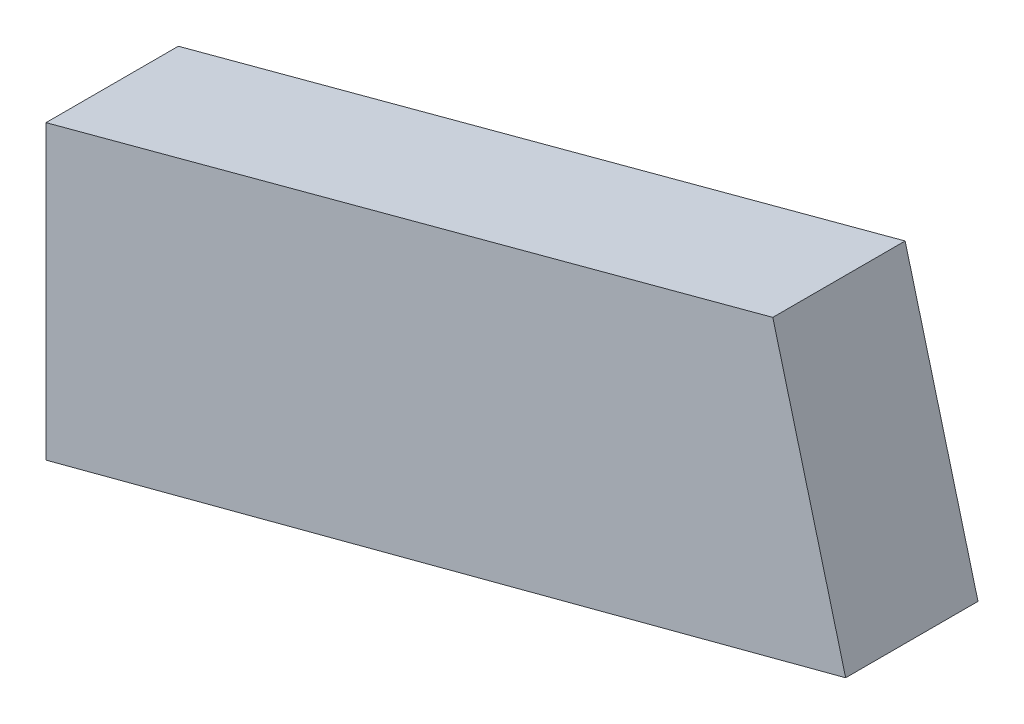
ISO-10303-21;
HEADER;
FILE_DESCRIPTION(('STEP AP214'),'2;1');
FILE_NAME('part.step','',(''),(''),'','','');
FILE_SCHEMA(('AUTOMOTIVE_DESIGN { 1 0 10303 214 1 1 1 1 }'));
ENDSEC;
DATA;
#1=APPLICATION_CONTEXT('core data for automotive mechanical design processes');
#2=APPLICATION_PROTOCOL_DEFINITION('international standard','automotive_design',2000,#1);
#3=PRODUCT_CONTEXT('',#1,'mechanical');
#4=PRODUCT('Part','Part','',(#3));
#5=PRODUCT_RELATED_PRODUCT_CATEGORY('part','',(#4));
#6=PRODUCT_DEFINITION_FORMATION('','',#4);
#7=PRODUCT_DEFINITION_CONTEXT('part definition',#1,'design');
#8=PRODUCT_DEFINITION('design','',#6,#7);
#9=PRODUCT_DEFINITION_SHAPE('','',#8);
#10=(LENGTH_UNIT() NAMED_UNIT(*) SI_UNIT(.MILLI.,.METRE.));
#11=(NAMED_UNIT(*) PLANE_ANGLE_UNIT() SI_UNIT($,.RADIAN.));
#12=(NAMED_UNIT(*) SI_UNIT($,.STERADIAN.) SOLID_ANGLE_UNIT());
#13=UNCERTAINTY_MEASURE_WITH_UNIT(LENGTH_MEASURE(1.E-05),#10,'distance_accuracy_value','');
#14=(GEOMETRIC_REPRESENTATION_CONTEXT(3) GLOBAL_UNCERTAINTY_ASSIGNED_CONTEXT((#13)) GLOBAL_UNIT_ASSIGNED_CONTEXT((#10,
#11,#12)) REPRESENTATION_CONTEXT('',''));
#15=CARTESIAN_POINT('',(0.,0.,0.));
#16=DIRECTION('',(0.,0.,1.));
#17=DIRECTION('',(1.,0.,0.));
#18=AXIS2_PLACEMENT_3D('',#15,#16,#17);
#19=CARTESIAN_POINT('',(0.,26.5033331540804,12.));
#20=DIRECTION('',(1.,0.,0.));
#21=DIRECTION('',(0.,1.,0.));
#22=AXIS2_PLACEMENT_3D('',#19,#20,#21);
#23=PLANE('',#22);
#24=DIRECTION('',(0.,-1.,0.));
#25=VECTOR('',#24,1.);
#26=CARTESIAN_POINT('',(0.,26.5033331540804,0.));
#27=LINE('',#26,#25);
#28=CARTESIAN_POINT('',(0.,26.5033331540804,0.));
#29=VERTEX_POINT('',#28);
#30=CARTESIAN_POINT('',(0.,0.,0.));
#31=VERTEX_POINT('',#30);
#32=EDGE_CURVE('E96',#29,#31,#27,.T.);
#33=ORIENTED_EDGE('',*,*,#32,.T.);
#34=DIRECTION('',(0.,0.,-1.));
#35=VECTOR('',#34,1.);
#36=CARTESIAN_POINT('',(0.,0.,12.));
#37=LINE('',#36,#35);
#38=CARTESIAN_POINT('',(0.,0.,12.));
#39=VERTEX_POINT('',#38);
#40=EDGE_CURVE('E11',#39,#31,#37,.T.);
#41=ORIENTED_EDGE('',*,*,#40,.F.);
#42=DIRECTION('',(0.,-1.,0.));
#43=VECTOR('',#42,1.);
#44=CARTESIAN_POINT('',(0.,26.5033331540804,12.));
#45=LINE('',#44,#43);
#46=CARTESIAN_POINT('',(0.,26.5033331540804,12.));
#47=VERTEX_POINT('',#46);
#48=EDGE_CURVE('E84',#47,#39,#45,.T.);
#49=ORIENTED_EDGE('',*,*,#48,.F.);
#50=DIRECTION('',(0.,0.,-1.));
#51=VECTOR('',#50,1.);
#52=CARTESIAN_POINT('',(0.,26.5033331540804,12.));
#53=LINE('',#52,#51);
#54=EDGE_CURVE('E92',#47,#29,#53,.T.);
#55=ORIENTED_EDGE('',*,*,#54,.T.);
#56=EDGE_LOOP('',(#33,#41,#49,#55));
#57=FACE_BOUND('',#56,.T.);
#58=ADVANCED_FACE('F33',(#57),#23,.F.);
#59=CARTESIAN_POINT('',(0.,0.,12.));
#60=DIRECTION('',(-0.25549690225118,0.966809874246251,0.));
#61=DIRECTION('',(-0.966809874246251,-0.25549690225118,0.));
#62=AXIS2_PLACEMENT_3D('',#59,#60,#61);
#63=PLANE('',#62);
#64=DIRECTION('',(0.966809874246251,0.25549690225118,0.));
#65=VECTOR('',#64,1.);
#66=CARTESIAN_POINT('',(0.,0.,0.));
#67=LINE('',#66,#65);
#68=CARTESIAN_POINT('',(72.5107405684688,19.1622676688385,0.));
#69=VERTEX_POINT('',#68);
#70=EDGE_CURVE('E88',#31,#69,#67,.T.);
#71=ORIENTED_EDGE('',*,*,#70,.T.);
#72=DIRECTION('',(0.,0.,-1.));
#73=VECTOR('',#72,1.);
#74=CARTESIAN_POINT('',(72.5107405684688,19.1622676688385,12.));
#75=LINE('',#74,#73);
#76=CARTESIAN_POINT('',(72.5107405684688,19.1622676688385,12.));
#77=VERTEX_POINT('',#76);
#78=EDGE_CURVE('E41',#77,#69,#75,.T.);
#79=ORIENTED_EDGE('',*,*,#78,.F.);
#80=DIRECTION('',(0.966809874246251,0.25549690225118,0.));
#81=VECTOR('',#80,1.);
#82=CARTESIAN_POINT('',(0.,0.,12.));
#83=LINE('',#82,#81);
#84=EDGE_CURVE('E79',#39,#77,#83,.T.);
#85=ORIENTED_EDGE('',*,*,#84,.F.);
#86=ORIENTED_EDGE('',*,*,#40,.T.);
#87=EDGE_LOOP('',(#71,#79,#85,#86));
#88=FACE_BOUND('',#87,.T.);
#89=ADVANCED_FACE('F87',(#88),#63,.F.);
#90=CARTESIAN_POINT('',(72.5107405684688,19.1622676688385,12.));
#91=DIRECTION('',(-0.966809874246251,-0.255496902251181,0.));
#92=DIRECTION('',(0.255496902251181,-0.966809874246251,0.));
#93=AXIS2_PLACEMENT_3D('',#90,#91,#92);
#94=PLANE('',#93);
#95=DIRECTION('',(-0.255496902251181,0.96680987424625,0.));
#96=VECTOR('',#95,1.);
#97=CARTESIAN_POINT('',(72.5107405684688,19.1622676688385,0.));
#98=LINE('',#97,#96);
#99=CARTESIAN_POINT('',(65.9040408166077,44.1622676688385,0.));
#100=VERTEX_POINT('',#99);
#101=EDGE_CURVE('E66',#69,#100,#98,.T.);
#102=ORIENTED_EDGE('',*,*,#101,.T.);
#103=DIRECTION('',(0.,0.,-1.));
#104=VECTOR('',#103,1.);
#105=CARTESIAN_POINT('',(65.9040408166077,44.1622676688385,12.));
#106=LINE('',#105,#104);
#107=CARTESIAN_POINT('',(65.9040408166077,44.1622676688385,12.));
#108=VERTEX_POINT('',#107);
#109=EDGE_CURVE('E89',#108,#100,#106,.T.);
#110=ORIENTED_EDGE('',*,*,#109,.F.);
#111=DIRECTION('',(-0.255496902251181,0.96680987424625,0.));
#112=VECTOR('',#111,1.);
#113=CARTESIAN_POINT('',(72.5107405684688,19.1622676688385,12.));
#114=LINE('',#113,#112);
#115=EDGE_CURVE('E82',#77,#108,#114,.T.);
#116=ORIENTED_EDGE('',*,*,#115,.F.);
#117=ORIENTED_EDGE('',*,*,#78,.T.);
#118=EDGE_LOOP('',(#102,#110,#116,#117));
#119=FACE_BOUND('',#118,.T.);
#120=ADVANCED_FACE('F90',(#119),#94,.F.);
#121=CARTESIAN_POINT('',(65.9040408166077,44.1622676688385,12.));
#122=DIRECTION('',(0.258819045102525,-0.965925826289067,0.));
#123=DIRECTION('',(0.965925826289067,0.258819045102525,0.));
#124=AXIS2_PLACEMENT_3D('',#121,#122,#123);
#125=PLANE('',#124);
#126=DIRECTION('',(-0.965925826289067,-0.258819045102525,0.));
#127=VECTOR('',#126,1.);
#128=CARTESIAN_POINT('',(65.9040408166077,44.1622676688385,0.));
#129=LINE('',#128,#127);
#130=EDGE_CURVE('E72',#100,#29,#129,.T.);
#131=ORIENTED_EDGE('',*,*,#130,.T.);
#132=ORIENTED_EDGE('',*,*,#54,.F.);
#133=DIRECTION('',(-0.965925826289067,-0.258819045102525,0.));
#134=VECTOR('',#133,1.);
#135=CARTESIAN_POINT('',(65.9040408166077,44.1622676688385,12.));
#136=LINE('',#135,#134);
#137=EDGE_CURVE('E49',#108,#47,#136,.T.);
#138=ORIENTED_EDGE('',*,*,#137,.F.);
#139=ORIENTED_EDGE('',*,*,#109,.T.);
#140=EDGE_LOOP('',(#131,#132,#138,#139));
#141=FACE_BOUND('',#140,.T.);
#142=ADVANCED_FACE('F103',(#141),#125,.F.);
#143=CARTESIAN_POINT('',(0.,0.,12.));
#144=DIRECTION('',(0.,0.,1.));
#145=DIRECTION('',(1.,0.,0.));
#146=AXIS2_PLACEMENT_3D('',#143,#144,#145);
#147=PLANE('',#146);
#148=ORIENTED_EDGE('',*,*,#48,.T.);
#149=ORIENTED_EDGE('',*,*,#84,.T.);
#150=ORIENTED_EDGE('',*,*,#115,.T.);
#151=ORIENTED_EDGE('',*,*,#137,.T.);
#152=EDGE_LOOP('',(#148,#149,#150,#151));
#153=FACE_BOUND('',#152,.T.);
#154=ADVANCED_FACE('F80',(#153),#147,.T.);
#155=CARTESIAN_POINT('',(0.,0.,0.));
#156=DIRECTION('',(0.,0.,1.));
#157=DIRECTION('',(1.,0.,0.));
#158=AXIS2_PLACEMENT_3D('',#155,#156,#157);
#159=PLANE('',#158);
#160=ORIENTED_EDGE('',*,*,#32,.F.);
#161=ORIENTED_EDGE('',*,*,#130,.F.);
#162=ORIENTED_EDGE('',*,*,#101,.F.);
#163=ORIENTED_EDGE('',*,*,#70,.F.);
#164=EDGE_LOOP('',(#160,#161,#162,#163));
#165=FACE_BOUND('',#164,.T.);
#166=ADVANCED_FACE('F106',(#165),#159,.F.);
#167=CLOSED_SHELL('',(#58,#89,#120,#142,#154,#166));
#168=MANIFOLD_SOLID_BREP('B2',#167);
#169=ADVANCED_BREP_SHAPE_REPRESENTATION('',(#18,#168),#14);
#170=SHAPE_DEFINITION_REPRESENTATION(#9,#169);
ENDSEC;
END-ISO-10303-21;
